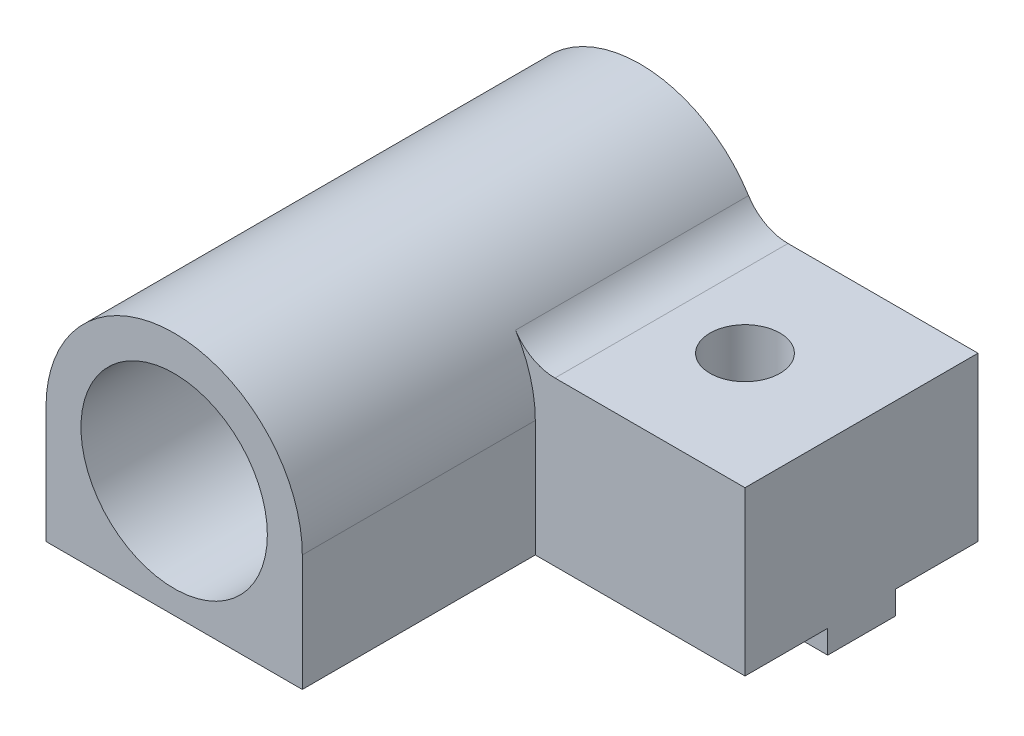
ISO-10303-21;
HEADER;
FILE_DESCRIPTION(('STEP AP214'),'2;1');
FILE_NAME('part.step','',(''),(''),'','','');
FILE_SCHEMA(('AUTOMOTIVE_DESIGN { 1 0 10303 214 1 1 1 1 }'));
ENDSEC;
DATA;
#1=APPLICATION_CONTEXT('core data for automotive mechanical design processes');
#2=APPLICATION_PROTOCOL_DEFINITION('international standard','automotive_design',2000,#1);
#3=PRODUCT_CONTEXT('',#1,'mechanical');
#4=PRODUCT('Part','Part','',(#3));
#5=PRODUCT_RELATED_PRODUCT_CATEGORY('part','',(#4));
#6=PRODUCT_DEFINITION_FORMATION('','',#4);
#7=PRODUCT_DEFINITION_CONTEXT('part definition',#1,'design');
#8=PRODUCT_DEFINITION('design','',#6,#7);
#9=PRODUCT_DEFINITION_SHAPE('','',#8);
#10=(LENGTH_UNIT() NAMED_UNIT(*) SI_UNIT(.MILLI.,.METRE.));
#11=(NAMED_UNIT(*) PLANE_ANGLE_UNIT() SI_UNIT($,.RADIAN.));
#12=(NAMED_UNIT(*) SI_UNIT($,.STERADIAN.) SOLID_ANGLE_UNIT());
#13=UNCERTAINTY_MEASURE_WITH_UNIT(LENGTH_MEASURE(1.E-05),#10,'distance_accuracy_value','');
#14=(GEOMETRIC_REPRESENTATION_CONTEXT(3) GLOBAL_UNCERTAINTY_ASSIGNED_CONTEXT((#13)) GLOBAL_UNIT_ASSIGNED_CONTEXT((#10,
#11,#12)) REPRESENTATION_CONTEXT('',''));
#15=CARTESIAN_POINT('',(0.,0.,0.));
#16=DIRECTION('',(0.,0.,1.));
#17=DIRECTION('',(1.,0.,0.));
#18=AXIS2_PLACEMENT_3D('',#15,#16,#17);
#19=CARTESIAN_POINT('',(0.,0.,10.));
#20=DIRECTION('',(0.,0.,-1.));
#21=DIRECTION('',(-1.,0.,0.));
#22=AXIS2_PLACEMENT_3D('',#19,#20,#21);
#23=PLANE('',#22);
#24=CARTESIAN_POINT('',(0.,0.,10.));
#25=DIRECTION('',(0.,0.,1.));
#26=DIRECTION('',(1.,0.,0.));
#27=AXIS2_PLACEMENT_3D('',#24,#25,#26);
#28=CIRCLE('',#27,5.5);
#29=CARTESIAN_POINT('',(5.5,0.,10.));
#30=VERTEX_POINT('',#29);
#31=CARTESIAN_POINT('',(4.65247843149816,2.93333333333333,10.));
#32=VERTEX_POINT('',#31);
#33=EDGE_CURVE('E177',#30,#32,#28,.T.);
#34=ORIENTED_EDGE('',*,*,#33,.F.);
#35=DIRECTION('',(0.,1.,0.));
#36=VECTOR('',#35,1.);
#37=CARTESIAN_POINT('',(5.5,0.,10.));
#38=LINE('',#37,#36);
#39=CARTESIAN_POINT('',(5.5,-5.,10.));
#40=VERTEX_POINT('',#39);
#41=EDGE_CURVE('E48',#40,#30,#38,.T.);
#42=ORIENTED_EDGE('',*,*,#41,.F.);
#43=DIRECTION('',(1.,0.,0.));
#44=VECTOR('',#43,1.);
#45=CARTESIAN_POINT('',(-5.5,-5.,10.));
#46=LINE('',#45,#44);
#47=CARTESIAN_POINT('',(14.5,-5.,10.));
#48=VERTEX_POINT('',#47);
#49=EDGE_CURVE('E249',#40,#48,#46,.T.);
#50=ORIENTED_EDGE('',*,*,#49,.T.);
#51=DIRECTION('',(0.,1.,0.));
#52=VECTOR('',#51,1.);
#53=CARTESIAN_POINT('',(14.5,-5.,10.));
#54=LINE('',#53,#52);
#55=CARTESIAN_POINT('',(14.5,2.,10.));
#56=VERTEX_POINT('',#55);
#57=EDGE_CURVE('E252',#48,#56,#54,.T.);
#58=ORIENTED_EDGE('',*,*,#57,.T.);
#59=DIRECTION('',(-1.,0.,0.));
#60=VECTOR('',#59,1.);
#61=CARTESIAN_POINT('',(14.5,2.,10.));
#62=LINE('',#61,#60);
#63=CARTESIAN_POINT('',(6.34428877022476,2.,10.));
#64=VERTEX_POINT('',#63);
#65=EDGE_CURVE('E247',#56,#64,#62,.T.);
#66=ORIENTED_EDGE('',*,*,#65,.T.);
#67=CARTESIAN_POINT('',(6.34428877022476,4.,10.));
#68=DIRECTION('',(0.,0.,-1.));
#69=DIRECTION('',(-1.,0.,0.));
#70=AXIS2_PLACEMENT_3D('',#67,#68,#69);
#71=CIRCLE('',#70,2.);
#72=EDGE_CURVE('E11',#64,#32,#71,.T.);
#73=ORIENTED_EDGE('',*,*,#72,.T.);
#74=EDGE_LOOP('',(#34,#42,#50,#58,#66,#73));
#75=FACE_BOUND('',#74,.T.);
#76=ADVANCED_FACE('F33',(#75),#23,.F.);
#77=CARTESIAN_POINT('',(-5.5,-6.,3.55));
#78=DIRECTION('',(0.,0.,1.));
#79=DIRECTION('',(1.,0.,0.));
#80=AXIS2_PLACEMENT_3D('',#77,#78,#79);
#81=PLANE('',#80);
#82=DIRECTION('',(1.,0.,0.));
#83=VECTOR('',#82,1.);
#84=CARTESIAN_POINT('',(-5.5,-6.,3.55));
#85=LINE('',#84,#83);
#86=CARTESIAN_POINT('',(9.88405728739344,-6.,3.55));
#87=VERTEX_POINT('',#86);
#88=CARTESIAN_POINT('',(14.5,-6.,3.55));
#89=VERTEX_POINT('',#88);
#90=EDGE_CURVE('E216',#87,#89,#85,.T.);
#91=ORIENTED_EDGE('',*,*,#90,.F.);
#92=DIRECTION('',(0.,1.,0.));
#93=VECTOR('',#92,1.);
#94=CARTESIAN_POINT('',(9.88405728739344,-6.,3.55));
#95=LINE('',#94,#93);
#96=CARTESIAN_POINT('',(9.88405728739344,-5.,3.55));
#97=VERTEX_POINT('',#96);
#98=EDGE_CURVE('E209',#87,#97,#95,.T.);
#99=ORIENTED_EDGE('',*,*,#98,.T.);
#100=DIRECTION('',(1.,0.,0.));
#101=VECTOR('',#100,1.);
#102=CARTESIAN_POINT('',(-5.5,-5.,3.55));
#103=LINE('',#102,#101);
#104=CARTESIAN_POINT('',(14.5,-5.,3.55));
#105=VERTEX_POINT('',#104);
#106=EDGE_CURVE('E212',#97,#105,#103,.T.);
#107=ORIENTED_EDGE('',*,*,#106,.T.);
#108=DIRECTION('',(0.,1.,0.));
#109=VECTOR('',#108,1.);
#110=CARTESIAN_POINT('',(14.5,-6.,3.55));
#111=LINE('',#110,#109);
#112=EDGE_CURVE('E237',#89,#105,#111,.T.);
#113=ORIENTED_EDGE('',*,*,#112,.F.);
#114=EDGE_LOOP('',(#91,#99,#107,#113));
#115=FACE_BOUND('',#114,.T.);
#116=ADVANCED_FACE('F313',(#115),#81,.F.);
#117=CARTESIAN_POINT('',(-5.5,-6.,6.45));
#118=DIRECTION('',(0.,0.,-1.));
#119=DIRECTION('',(-1.,0.,0.));
#120=AXIS2_PLACEMENT_3D('',#117,#118,#119);
#121=PLANE('',#120);
#122=DIRECTION('',(-1.,0.,0.));
#123=VECTOR('',#122,1.);
#124=CARTESIAN_POINT('',(-5.5,-6.,6.45));
#125=LINE('',#124,#123);
#126=CARTESIAN_POINT('',(9.11594271260658,-6.,6.45));
#127=VERTEX_POINT('',#126);
#128=CARTESIAN_POINT('',(-5.5,-6.,6.45));
#129=VERTEX_POINT('',#128);
#130=EDGE_CURVE('E223',#127,#129,#125,.T.);
#131=ORIENTED_EDGE('',*,*,#130,.F.);
#132=DIRECTION('',(0.,1.,0.));
#133=VECTOR('',#132,1.);
#134=CARTESIAN_POINT('',(9.11594271260658,-6.,6.45));
#135=LINE('',#134,#133);
#136=CARTESIAN_POINT('',(9.11594271260658,-5.,6.45));
#137=VERTEX_POINT('',#136);
#138=EDGE_CURVE('E200',#127,#137,#135,.T.);
#139=ORIENTED_EDGE('',*,*,#138,.T.);
#140=DIRECTION('',(-1.,0.,0.));
#141=VECTOR('',#140,1.);
#142=CARTESIAN_POINT('',(-5.5,-5.,6.45));
#143=LINE('',#142,#141);
#144=CARTESIAN_POINT('',(-5.5,-5.,6.45));
#145=VERTEX_POINT('',#144);
#146=EDGE_CURVE('E230',#137,#145,#143,.T.);
#147=ORIENTED_EDGE('',*,*,#146,.T.);
#148=DIRECTION('',(0.,1.,0.));
#149=VECTOR('',#148,1.);
#150=CARTESIAN_POINT('',(-5.5,-6.,6.45));
#151=LINE('',#150,#149);
#152=EDGE_CURVE('E157',#129,#145,#151,.T.);
#153=ORIENTED_EDGE('',*,*,#152,.F.);
#154=EDGE_LOOP('',(#131,#139,#147,#153));
#155=FACE_BOUND('',#154,.T.);
#156=ADVANCED_FACE('F318',(#155),#121,.F.);
#157=CARTESIAN_POINT('',(0.,-6.,0.));
#158=DIRECTION('',(0.,-1.,0.));
#159=DIRECTION('',(0.,0.,-1.));
#160=AXIS2_PLACEMENT_3D('',#157,#158,#159);
#161=PLANE('',#160);
#162=CARTESIAN_POINT('',(9.50000000000001,-6.,5.));
#163=DIRECTION('',(0.,-1.,0.));
#164=DIRECTION('',(0.,0.,-1.));
#165=AXIS2_PLACEMENT_3D('',#162,#163,#164);
#166=CIRCLE('',#165,1.5);
#167=CARTESIAN_POINT('',(9.88405728739344,-6.,6.45));
#168=VERTEX_POINT('',#167);
#169=EDGE_CURVE('E273',#87,#168,#166,.T.);
#170=ORIENTED_EDGE('',*,*,#169,.F.);
#171=ORIENTED_EDGE('',*,*,#90,.T.);
#172=DIRECTION('',(0.,0.,1.));
#173=VECTOR('',#172,1.);
#174=CARTESIAN_POINT('',(14.5,-6.,6.45));
#175=LINE('',#174,#173);
#176=CARTESIAN_POINT('',(14.5,-6.,6.45));
#177=VERTEX_POINT('',#176);
#178=EDGE_CURVE('E221',#89,#177,#175,.T.);
#179=ORIENTED_EDGE('',*,*,#178,.T.);
#180=EDGE_CURVE('E224',#177,#168,#125,.T.);
#181=ORIENTED_EDGE('',*,*,#180,.T.);
#182=EDGE_LOOP('',(#170,#171,#179,#181));
#183=FACE_BOUND('',#182,.T.);
#184=ADVANCED_FACE('F331',(#183),#161,.T.);
#185=CARTESIAN_POINT('',(-5.5,-5.,10.));
#186=DIRECTION('',(0.,1.,0.));
#187=DIRECTION('',(0.,0.,1.));
#188=AXIS2_PLACEMENT_3D('',#185,#186,#187);
#189=PLANE('',#188);
#190=ORIENTED_EDGE('',*,*,#146,.F.);
#191=CARTESIAN_POINT('',(9.50000000000001,-5.,5.));
#192=DIRECTION('',(0.,1.,0.));
#193=DIRECTION('',(0.,0.,1.));
#194=AXIS2_PLACEMENT_3D('',#191,#192,#193);
#195=CIRCLE('',#194,1.5);
#196=CARTESIAN_POINT('',(9.88405728739344,-5.,6.45));
#197=VERTEX_POINT('',#196);
#198=EDGE_CURVE('E197',#137,#197,#195,.T.);
#199=ORIENTED_EDGE('',*,*,#198,.T.);
#200=CARTESIAN_POINT('',(14.5,-5.,6.45));
#201=VERTEX_POINT('',#200);
#202=EDGE_CURVE('E217',#201,#197,#143,.T.);
#203=ORIENTED_EDGE('',*,*,#202,.F.);
#204=DIRECTION('',(0.,0.,-1.));
#205=VECTOR('',#204,1.);
#206=CARTESIAN_POINT('',(14.5,-5.,10.));
#207=LINE('',#206,#205);
#208=EDGE_CURVE('E267',#48,#201,#207,.T.);
#209=ORIENTED_EDGE('',*,*,#208,.F.);
#210=ORIENTED_EDGE('',*,*,#49,.F.);
#211=DIRECTION('',(0.,0.,-1.));
#212=VECTOR('',#211,1.);
#213=CARTESIAN_POINT('',(5.5,-5.,20.));
#214=LINE('',#213,#212);
#215=CARTESIAN_POINT('',(5.5,-5.,20.));
#216=VERTEX_POINT('',#215);
#217=EDGE_CURVE('E167',#216,#40,#214,.T.);
#218=ORIENTED_EDGE('',*,*,#217,.F.);
#219=DIRECTION('',(1.,0.,0.));
#220=VECTOR('',#219,1.);
#221=CARTESIAN_POINT('',(-5.5,-5.,20.));
#222=LINE('',#221,#220);
#223=CARTESIAN_POINT('',(-5.5,-5.,20.));
#224=VERTEX_POINT('',#223);
#225=EDGE_CURVE('E164',#224,#216,#222,.T.);
#226=ORIENTED_EDGE('',*,*,#225,.F.);
#227=DIRECTION('',(0.,0.,-1.));
#228=VECTOR('',#227,1.);
#229=CARTESIAN_POINT('',(-5.5,-5.,10.));
#230=LINE('',#229,#228);
#231=EDGE_CURVE('E148',#224,#145,#230,.T.);
#232=ORIENTED_EDGE('',*,*,#231,.T.);
#233=EDGE_LOOP('',(#190,#199,#203,#209,#210,#218,#226,#232));
#234=FACE_BOUND('',#233,.T.);
#235=ADVANCED_FACE('F165',(#234),#189,.F.);
#236=ORIENTED_EDGE('',*,*,#106,.F.);
#237=CARTESIAN_POINT('',(9.50000000000001,-5.,5.));
#238=DIRECTION('',(0.,1.,0.));
#239=DIRECTION('',(0.,0.,1.));
#240=AXIS2_PLACEMENT_3D('',#237,#238,#239);
#241=CIRCLE('',#240,1.5);
#242=CARTESIAN_POINT('',(9.11594271260657,-5.,3.55));
#243=VERTEX_POINT('',#242);
#244=EDGE_CURVE('E206',#97,#243,#241,.T.);
#245=ORIENTED_EDGE('',*,*,#244,.T.);
#246=CARTESIAN_POINT('',(-5.5,-5.,3.55));
#247=VERTEX_POINT('',#246);
#248=EDGE_CURVE('E227',#247,#243,#103,.T.);
#249=ORIENTED_EDGE('',*,*,#248,.F.);
#250=CARTESIAN_POINT('',(-5.5,-5.,0.));
#251=VERTEX_POINT('',#250);
#252=EDGE_CURVE('E161',#247,#251,#230,.T.);
#253=ORIENTED_EDGE('',*,*,#252,.T.);
#254=DIRECTION('',(1.,0.,0.));
#255=VECTOR('',#254,1.);
#256=CARTESIAN_POINT('',(-5.5,-5.,0.));
#257=LINE('',#256,#255);
#258=CARTESIAN_POINT('',(14.5,-5.,0.));
#259=VERTEX_POINT('',#258);
#260=EDGE_CURVE('E260',#251,#259,#257,.T.);
#261=ORIENTED_EDGE('',*,*,#260,.T.);
#262=EDGE_CURVE('E266',#105,#259,#207,.T.);
#263=ORIENTED_EDGE('',*,*,#262,.F.);
#264=EDGE_LOOP('',(#236,#245,#249,#253,#261,#263));
#265=FACE_BOUND('',#264,.T.);
#266=ADVANCED_FACE('F297',(#265),#189,.F.);
#267=CARTESIAN_POINT('',(0.,0.,0.));
#268=DIRECTION('',(0.,0.,-1.));
#269=DIRECTION('',(-1.,0.,0.));
#270=AXIS2_PLACEMENT_3D('',#267,#268,#269);
#271=PLANE('',#270);
#272=DIRECTION('',(-1.,0.,0.));
#273=VECTOR('',#272,1.);
#274=CARTESIAN_POINT('',(14.5,2.,0.));
#275=LINE('',#274,#273);
#276=CARTESIAN_POINT('',(14.5,2.,0.));
#277=VERTEX_POINT('',#276);
#278=CARTESIAN_POINT('',(6.34428877022476,2.,0.));
#279=VERTEX_POINT('',#278);
#280=EDGE_CURVE('E246',#277,#279,#275,.T.);
#281=ORIENTED_EDGE('',*,*,#280,.F.);
#282=DIRECTION('',(0.,1.,0.));
#283=VECTOR('',#282,1.);
#284=CARTESIAN_POINT('',(14.5,-5.,0.));
#285=LINE('',#284,#283);
#286=EDGE_CURVE('E250',#259,#277,#285,.T.);
#287=ORIENTED_EDGE('',*,*,#286,.F.);
#288=ORIENTED_EDGE('',*,*,#260,.F.);
#289=DIRECTION('',(0.,-1.,0.));
#290=VECTOR('',#289,1.);
#291=CARTESIAN_POINT('',(-5.5,0.,0.));
#292=LINE('',#291,#290);
#293=CARTESIAN_POINT('',(-5.5,0.,0.));
#294=VERTEX_POINT('',#293);
#295=EDGE_CURVE('E258',#294,#251,#292,.T.);
#296=ORIENTED_EDGE('',*,*,#295,.F.);
#297=CARTESIAN_POINT('',(0.,0.,0.));
#298=DIRECTION('',(0.,0.,1.));
#299=DIRECTION('',(-1.,0.,0.));
#300=AXIS2_PLACEMENT_3D('',#297,#298,#299);
#301=CIRCLE('',#300,5.5);
#302=CARTESIAN_POINT('',(4.65247843149816,2.93333333333333,0.));
#303=VERTEX_POINT('',#302);
#304=EDGE_CURVE('E256',#303,#294,#301,.T.);
#305=ORIENTED_EDGE('',*,*,#304,.F.);
#306=CARTESIAN_POINT('',(6.34428877022476,4.,0.));
#307=DIRECTION('',(0.,0.,-1.));
#308=DIRECTION('',(-1.,0.,0.));
#309=AXIS2_PLACEMENT_3D('',#306,#307,#308);
#310=CIRCLE('',#309,2.);
#311=EDGE_CURVE('E41',#303,#279,#310,.F.);
#312=ORIENTED_EDGE('',*,*,#311,.T.);
#313=EDGE_LOOP('',(#281,#287,#288,#296,#305,#312));
#314=FACE_BOUND('',#313,.T.);
#315=CARTESIAN_POINT('',(0.,0.,0.));
#316=DIRECTION('',(0.,0.,1.));
#317=DIRECTION('',(1.,0.,0.));
#318=AXIS2_PLACEMENT_3D('',#315,#316,#317);
#319=CIRCLE('',#318,4.);
#320=CARTESIAN_POINT('',(4.,0.,0.));
#321=VERTEX_POINT('',#320);
#322=EDGE_CURVE('E243',#321,#321,#319,.T.);
#323=ORIENTED_EDGE('',*,*,#322,.T.);
#324=EDGE_LOOP('',(#323));
#325=FACE_BOUND('',#324,.T.);
#326=ADVANCED_FACE('F280',(#314,#325),#271,.T.);
#327=CARTESIAN_POINT('',(14.5,2.,10.));
#328=DIRECTION('',(0.,-1.,0.));
#329=DIRECTION('',(1.,0.,0.));
#330=AXIS2_PLACEMENT_3D('',#327,#328,#329);
#331=PLANE('',#330);
#332=CARTESIAN_POINT('',(9.50000000000001,2.,5.));
#333=DIRECTION('',(0.,1.,0.));
#334=DIRECTION('',(-1.,0.,0.));
#335=AXIS2_PLACEMENT_3D('',#332,#333,#334);
#336=CIRCLE('',#335,1.5);
#337=CARTESIAN_POINT('',(8.,2.,5.));
#338=VERTEX_POINT('',#337);
#339=EDGE_CURVE('E191',#338,#338,#336,.T.);
#340=ORIENTED_EDGE('',*,*,#339,.F.);
#341=EDGE_LOOP('',(#340));
#342=FACE_BOUND('',#341,.T.);
#343=ORIENTED_EDGE('',*,*,#280,.T.);
#344=DIRECTION('',(0.,0.,1.));
#345=VECTOR('',#344,1.);
#346=CARTESIAN_POINT('',(6.34428877022476,2.,10.));
#347=LINE('',#346,#345);
#348=EDGE_CURVE('E56',#279,#64,#347,.T.);
#349=ORIENTED_EDGE('',*,*,#348,.T.);
#350=ORIENTED_EDGE('',*,*,#65,.F.);
#351=DIRECTION('',(0.,0.,-1.));
#352=VECTOR('',#351,1.);
#353=CARTESIAN_POINT('',(14.5,2.,10.));
#354=LINE('',#353,#352);
#355=EDGE_CURVE('E254',#56,#277,#354,.T.);
#356=ORIENTED_EDGE('',*,*,#355,.T.);
#357=EDGE_LOOP('',(#343,#349,#350,#356));
#358=FACE_BOUND('',#357,.T.);
#359=ADVANCED_FACE('F286',(#342,#358),#331,.F.);
#360=CARTESIAN_POINT('',(0.,0.,10.));
#361=DIRECTION('',(0.,0.,-1.));
#362=DIRECTION('',(-1.,0.,0.));
#363=AXIS2_PLACEMENT_3D('',#360,#361,#362);
#364=CYLINDRICAL_SURFACE('',#363,5.5);
#365=DIRECTION('',(0.,0.,-1.));
#366=VECTOR('',#365,1.);
#367=CARTESIAN_POINT('',(-5.5,0.,10.));
#368=LINE('',#367,#366);
#369=CARTESIAN_POINT('',(-5.5,0.,20.));
#370=VERTEX_POINT('',#369);
#371=EDGE_CURVE('E160',#370,#294,#368,.T.);
#372=ORIENTED_EDGE('',*,*,#371,.F.);
#373=CARTESIAN_POINT('',(0.,0.,20.));
#374=DIRECTION('',(0.,0.,1.));
#375=DIRECTION('',(1.,0.,0.));
#376=AXIS2_PLACEMENT_3D('',#373,#374,#375);
#377=CIRCLE('',#376,5.5);
#378=CARTESIAN_POINT('',(5.5,0.,20.));
#379=VERTEX_POINT('',#378);
#380=EDGE_CURVE('E176',#379,#370,#377,.T.);
#381=ORIENTED_EDGE('',*,*,#380,.F.);
#382=DIRECTION('',(0.,0.,-1.));
#383=VECTOR('',#382,1.);
#384=CARTESIAN_POINT('',(5.5,0.,20.));
#385=LINE('',#384,#383);
#386=EDGE_CURVE('E186',#379,#30,#385,.T.);
#387=ORIENTED_EDGE('',*,*,#386,.T.);
#388=ORIENTED_EDGE('',*,*,#33,.T.);
#389=DIRECTION('',(0.,0.,-1.));
#390=VECTOR('',#389,1.);
#391=CARTESIAN_POINT('',(4.65247843149816,2.93333333333333,10.));
#392=LINE('',#391,#390);
#393=EDGE_CURVE('E274',#32,#303,#392,.T.);
#394=ORIENTED_EDGE('',*,*,#393,.T.);
#395=ORIENTED_EDGE('',*,*,#304,.T.);
#396=EDGE_LOOP('',(#372,#381,#387,#388,#394,#395));
#397=FACE_BOUND('',#396,.T.);
#398=ADVANCED_FACE('F301',(#397),#364,.T.);
#399=CARTESIAN_POINT('',(-5.5,0.,10.));
#400=DIRECTION('',(1.,0.,0.));
#401=DIRECTION('',(0.,1.,0.));
#402=AXIS2_PLACEMENT_3D('',#399,#400,#401);
#403=PLANE('',#402);
#404=ORIENTED_EDGE('',*,*,#295,.T.);
#405=ORIENTED_EDGE('',*,*,#252,.F.);
#406=DIRECTION('',(0.,1.,0.));
#407=VECTOR('',#406,1.);
#408=CARTESIAN_POINT('',(-5.5,-6.,3.55));
#409=LINE('',#408,#407);
#410=CARTESIAN_POINT('',(-5.5,-6.,3.55));
#411=VERTEX_POINT('',#410);
#412=EDGE_CURVE('E240',#411,#247,#409,.T.);
#413=ORIENTED_EDGE('',*,*,#412,.F.);
#414=DIRECTION('',(0.,0.,-1.));
#415=VECTOR('',#414,1.);
#416=CARTESIAN_POINT('',(-5.5,-6.,6.45));
#417=LINE('',#416,#415);
#418=EDGE_CURVE('E213',#129,#411,#417,.T.);
#419=ORIENTED_EDGE('',*,*,#418,.F.);
#420=ORIENTED_EDGE('',*,*,#152,.T.);
#421=ORIENTED_EDGE('',*,*,#231,.F.);
#422=DIRECTION('',(0.,-1.,0.));
#423=VECTOR('',#422,1.);
#424=CARTESIAN_POINT('',(-5.5,-5.,20.));
#425=LINE('',#424,#423);
#426=EDGE_CURVE('E154',#370,#224,#425,.T.);
#427=ORIENTED_EDGE('',*,*,#426,.F.);
#428=ORIENTED_EDGE('',*,*,#371,.T.);
#429=EDGE_LOOP('',(#404,#405,#413,#419,#420,#421,#427,#428));
#430=FACE_BOUND('',#429,.T.);
#431=ADVANCED_FACE('F151',(#430),#403,.F.);
#432=CARTESIAN_POINT('',(14.5,-5.,10.));
#433=DIRECTION('',(-1.,0.,0.));
#434=DIRECTION('',(0.,-1.,0.));
#435=AXIS2_PLACEMENT_3D('',#432,#433,#434);
#436=PLANE('',#435);
#437=ORIENTED_EDGE('',*,*,#286,.T.);
#438=ORIENTED_EDGE('',*,*,#355,.F.);
#439=ORIENTED_EDGE('',*,*,#57,.F.);
#440=ORIENTED_EDGE('',*,*,#208,.T.);
#441=DIRECTION('',(0.,1.,0.));
#442=VECTOR('',#441,1.);
#443=CARTESIAN_POINT('',(14.5,-6.,6.45));
#444=LINE('',#443,#442);
#445=EDGE_CURVE('E234',#177,#201,#444,.T.);
#446=ORIENTED_EDGE('',*,*,#445,.F.);
#447=ORIENTED_EDGE('',*,*,#178,.F.);
#448=ORIENTED_EDGE('',*,*,#112,.T.);
#449=ORIENTED_EDGE('',*,*,#262,.T.);
#450=EDGE_LOOP('',(#437,#438,#439,#440,#446,#447,#448,#449));
#451=FACE_BOUND('',#450,.T.);
#452=ADVANCED_FACE('F292',(#451),#436,.F.);
#453=CARTESIAN_POINT('',(0.,0.,10.));
#454=DIRECTION('',(0.,0.,-1.));
#455=DIRECTION('',(-1.,0.,0.));
#456=AXIS2_PLACEMENT_3D('',#453,#454,#455);
#457=CYLINDRICAL_SURFACE('',#456,4.);
#458=ORIENTED_EDGE('',*,*,#322,.F.);
#459=EDGE_LOOP('',(#458));
#460=FACE_BOUND('',#459,.T.);
#461=CARTESIAN_POINT('',(0.,0.,20.));
#462=DIRECTION('',(0.,0.,1.));
#463=DIRECTION('',(1.,0.,0.));
#464=AXIS2_PLACEMENT_3D('',#461,#462,#463);
#465=CIRCLE('',#464,4.);
#466=CARTESIAN_POINT('',(4.,0.,20.));
#467=VERTEX_POINT('',#466);
#468=EDGE_CURVE('E182',#467,#467,#465,.T.);
#469=ORIENTED_EDGE('',*,*,#468,.T.);
#470=EDGE_LOOP('',(#469));
#471=FACE_BOUND('',#470,.T.);
#472=ADVANCED_FACE('F324',(#460,#471),#457,.F.);
#473=ORIENTED_EDGE('',*,*,#248,.T.);
#474=DIRECTION('',(0.,1.,0.));
#475=VECTOR('',#474,1.);
#476=CARTESIAN_POINT('',(9.11594271260657,-6.,3.55));
#477=LINE('',#476,#475);
#478=CARTESIAN_POINT('',(9.11594271260657,-6.,3.55));
#479=VERTEX_POINT('',#478);
#480=EDGE_CURVE('E203',#243,#479,#477,.F.);
#481=ORIENTED_EDGE('',*,*,#480,.T.);
#482=EDGE_CURVE('E218',#411,#479,#85,.T.);
#483=ORIENTED_EDGE('',*,*,#482,.F.);
#484=ORIENTED_EDGE('',*,*,#412,.T.);
#485=EDGE_LOOP('',(#473,#481,#483,#484));
#486=FACE_BOUND('',#485,.T.);
#487=ADVANCED_FACE('F321',(#486),#81,.F.);
#488=ORIENTED_EDGE('',*,*,#202,.T.);
#489=DIRECTION('',(0.,1.,0.));
#490=VECTOR('',#489,1.);
#491=CARTESIAN_POINT('',(9.88405728739344,-6.,6.45));
#492=LINE('',#491,#490);
#493=EDGE_CURVE('E194',#197,#168,#492,.F.);
#494=ORIENTED_EDGE('',*,*,#493,.T.);
#495=ORIENTED_EDGE('',*,*,#180,.F.);
#496=ORIENTED_EDGE('',*,*,#445,.T.);
#497=EDGE_LOOP('',(#488,#494,#495,#496));
#498=FACE_BOUND('',#497,.T.);
#499=ADVANCED_FACE('F350',(#498),#121,.F.);
#500=EDGE_CURVE('E271',#127,#479,#166,.T.);
#501=ORIENTED_EDGE('',*,*,#500,.F.);
#502=ORIENTED_EDGE('',*,*,#130,.T.);
#503=ORIENTED_EDGE('',*,*,#418,.T.);
#504=ORIENTED_EDGE('',*,*,#482,.T.);
#505=EDGE_LOOP('',(#501,#502,#503,#504));
#506=FACE_BOUND('',#505,.T.);
#507=ADVANCED_FACE('F344',(#506),#161,.T.);
#508=CARTESIAN_POINT('',(9.50000000000001,-6.,5.));
#509=DIRECTION('',(0.,1.,0.));
#510=DIRECTION('',(-1.,0.,0.));
#511=AXIS2_PLACEMENT_3D('',#508,#509,#510);
#512=CYLINDRICAL_SURFACE('',#511,1.5);
#513=ORIENTED_EDGE('',*,*,#339,.T.);
#514=EDGE_LOOP('',(#513));
#515=FACE_BOUND('',#514,.T.);
#516=ORIENTED_EDGE('',*,*,#169,.T.);
#517=ORIENTED_EDGE('',*,*,#493,.F.);
#518=ORIENTED_EDGE('',*,*,#198,.F.);
#519=ORIENTED_EDGE('',*,*,#138,.F.);
#520=ORIENTED_EDGE('',*,*,#500,.T.);
#521=ORIENTED_EDGE('',*,*,#480,.F.);
#522=ORIENTED_EDGE('',*,*,#244,.F.);
#523=ORIENTED_EDGE('',*,*,#98,.F.);
#524=EDGE_LOOP('',(#516,#517,#518,#519,#520,#521,#522,#523));
#525=FACE_BOUND('',#524,.T.);
#526=ADVANCED_FACE('F341',(#515,#525),#512,.F.);
#527=CARTESIAN_POINT('',(6.34428877022476,4.,10.));
#528=DIRECTION('',(0.,0.,-1.));
#529=DIRECTION('',(-1.,0.,0.));
#530=AXIS2_PLACEMENT_3D('',#527,#528,#529);
#531=CYLINDRICAL_SURFACE('',#530,2.);
#532=ORIENTED_EDGE('',*,*,#72,.F.);
#533=ORIENTED_EDGE('',*,*,#348,.F.);
#534=ORIENTED_EDGE('',*,*,#311,.F.);
#535=ORIENTED_EDGE('',*,*,#393,.F.);
#536=EDGE_LOOP('',(#532,#533,#534,#535));
#537=FACE_BOUND('',#536,.T.);
#538=ADVANCED_FACE('F35',(#537),#531,.F.);
#539=CARTESIAN_POINT('',(0.,0.,20.));
#540=DIRECTION('',(0.,0.,1.));
#541=DIRECTION('',(1.,0.,0.));
#542=AXIS2_PLACEMENT_3D('',#539,#540,#541);
#543=PLANE('',#542);
#544=ORIENTED_EDGE('',*,*,#426,.T.);
#545=ORIENTED_EDGE('',*,*,#225,.T.);
#546=DIRECTION('',(0.,1.,0.));
#547=VECTOR('',#546,1.);
#548=CARTESIAN_POINT('',(5.5,0.,20.));
#549=LINE('',#548,#547);
#550=EDGE_CURVE('E170',#216,#379,#549,.T.);
#551=ORIENTED_EDGE('',*,*,#550,.T.);
#552=ORIENTED_EDGE('',*,*,#380,.T.);
#553=EDGE_LOOP('',(#544,#545,#551,#552));
#554=FACE_BOUND('',#553,.T.);
#555=ORIENTED_EDGE('',*,*,#468,.F.);
#556=EDGE_LOOP('',(#555));
#557=FACE_BOUND('',#556,.T.);
#558=ADVANCED_FACE('F173',(#554,#557),#543,.T.);
#559=CARTESIAN_POINT('',(5.5,0.,20.));
#560=DIRECTION('',(-1.,0.,0.));
#561=DIRECTION('',(0.,0.,1.));
#562=AXIS2_PLACEMENT_3D('',#559,#560,#561);
#563=PLANE('',#562);
#564=ORIENTED_EDGE('',*,*,#41,.T.);
#565=ORIENTED_EDGE('',*,*,#386,.F.);
#566=ORIENTED_EDGE('',*,*,#550,.F.);
#567=ORIENTED_EDGE('',*,*,#217,.T.);
#568=EDGE_LOOP('',(#564,#565,#566,#567));
#569=FACE_BOUND('',#568,.T.);
#570=ADVANCED_FACE('F304',(#569),#563,.F.);
#571=CLOSED_SHELL('',(#76,#116,#156,#184,#235,#266,#326,#359,#398,#431,#452,#472,#487,#499,#507,
#526,#538,#558,#570));
#572=MANIFOLD_SOLID_BREP('B2',#571);
#573=ADVANCED_BREP_SHAPE_REPRESENTATION('',(#18,#572),#14);
#574=SHAPE_DEFINITION_REPRESENTATION(#9,#573);
ENDSEC;
END-ISO-10303-21;
